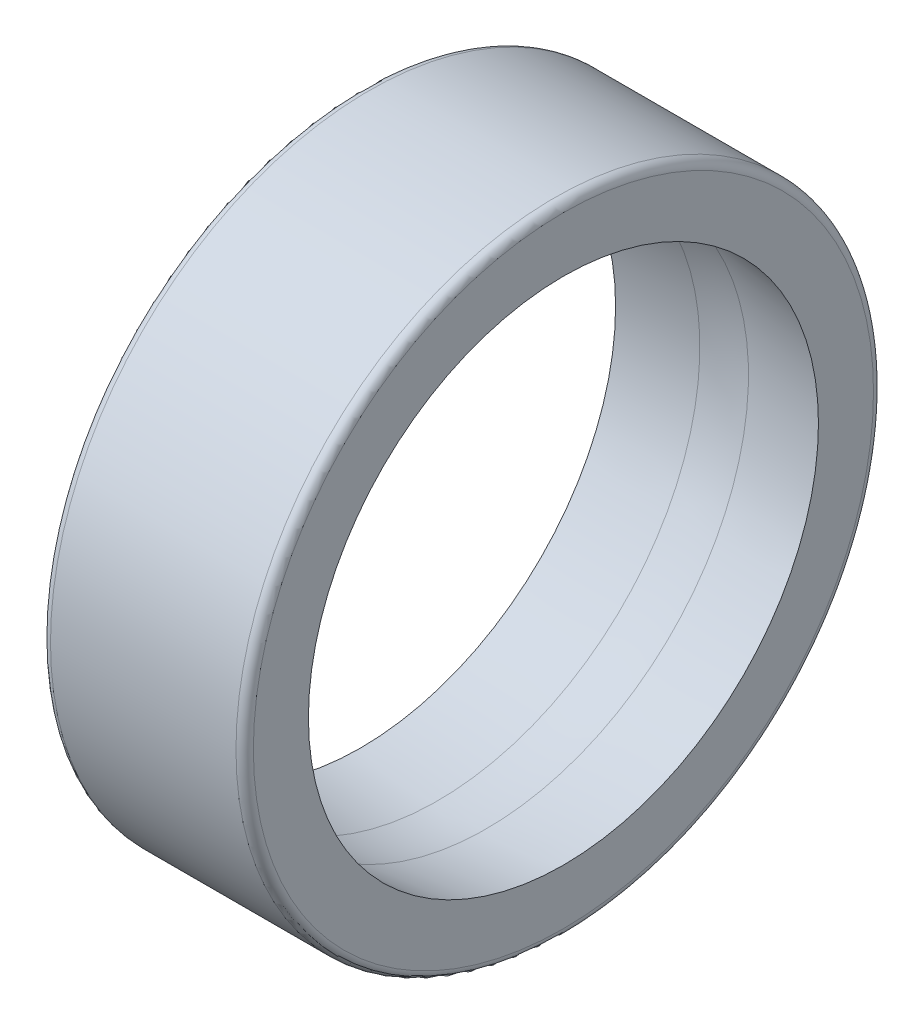
ISO-10303-21;
HEADER;
FILE_DESCRIPTION(('STEP AP214'),'2;1');
FILE_NAME('part.step','',(''),(''),'','','');
FILE_SCHEMA(('AUTOMOTIVE_DESIGN { 1 0 10303 214 1 1 1 1 }'));
ENDSEC;
DATA;
#1=APPLICATION_CONTEXT('core data for automotive mechanical design processes');
#2=APPLICATION_PROTOCOL_DEFINITION('international standard','automotive_design',2000,#1);
#3=PRODUCT_CONTEXT('',#1,'mechanical');
#4=PRODUCT('Part','Part','',(#3));
#5=PRODUCT_RELATED_PRODUCT_CATEGORY('part','',(#4));
#6=PRODUCT_DEFINITION_FORMATION('','',#4);
#7=PRODUCT_DEFINITION_CONTEXT('part definition',#1,'design');
#8=PRODUCT_DEFINITION('design','',#6,#7);
#9=PRODUCT_DEFINITION_SHAPE('','',#8);
#10=(LENGTH_UNIT() NAMED_UNIT(*) SI_UNIT(.MILLI.,.METRE.));
#11=(NAMED_UNIT(*) PLANE_ANGLE_UNIT() SI_UNIT($,.RADIAN.));
#12=(NAMED_UNIT(*) SI_UNIT($,.STERADIAN.) SOLID_ANGLE_UNIT());
#13=UNCERTAINTY_MEASURE_WITH_UNIT(LENGTH_MEASURE(1.E-05),#10,'distance_accuracy_value','');
#14=(GEOMETRIC_REPRESENTATION_CONTEXT(3) GLOBAL_UNCERTAINTY_ASSIGNED_CONTEXT((#13)) GLOBAL_UNIT_ASSIGNED_CONTEXT((#10,
#11,#12)) REPRESENTATION_CONTEXT('',''));
#15=CARTESIAN_POINT('',(0.,0.,0.));
#16=DIRECTION('',(0.,0.,1.));
#17=DIRECTION('',(1.,0.,0.));
#18=AXIS2_PLACEMENT_3D('',#15,#16,#17);
#19=CARTESIAN_POINT('',(0.,10.7,0.));
#20=DIRECTION('',(1.,0.,0.));
#21=DIRECTION('',(0.,0.,-1.));
#22=AXIS2_PLACEMENT_3D('',#19,#20,#21);
#23=PLANE('',#22);
#24=CARTESIAN_POINT('',(0.,0.,0.));
#25=DIRECTION('',(-1.,0.,0.));
#26=DIRECTION('',(0.,0.,1.));
#27=AXIS2_PLACEMENT_3D('',#24,#25,#26);
#28=CIRCLE('',#27,8.8);
#29=CARTESIAN_POINT('',(0.,0.,8.8));
#30=VERTEX_POINT('',#29);
#31=EDGE_CURVE('E61',#30,#30,#28,.T.);
#32=ORIENTED_EDGE('',*,*,#31,.F.);
#33=EDGE_LOOP('',(#32));
#34=FACE_BOUND('',#33,.T.);
#35=CARTESIAN_POINT('',(0.,0.,0.));
#36=DIRECTION('',(-1.,0.,0.));
#37=DIRECTION('',(0.,0.,1.));
#38=AXIS2_PLACEMENT_3D('',#35,#36,#37);
#39=CIRCLE('',#38,10.7);
#40=CARTESIAN_POINT('',(0.,0.,10.7));
#41=VERTEX_POINT('',#40);
#42=EDGE_CURVE('E10',#41,#41,#39,.T.);
#43=ORIENTED_EDGE('',*,*,#42,.T.);
#44=EDGE_LOOP('',(#43));
#45=FACE_BOUND('',#44,.T.);
#46=ADVANCED_FACE('F33',(#34,#45),#23,.F.);
#47=CARTESIAN_POINT('',(0.299999999999937,0.,0.));
#48=DIRECTION('',(-1.,0.,0.));
#49=DIRECTION('',(0.,0.,1.));
#50=AXIS2_PLACEMENT_3D('',#47,#48,#49);
#51=TOROIDAL_SURFACE('',#50,10.7000000000001,0.299999999999937);
#52=ORIENTED_EDGE('',*,*,#42,.F.);
#53=EDGE_LOOP('',(#52));
#54=FACE_BOUND('',#53,.T.);
#55=CARTESIAN_POINT('',(0.300000000000002,0.,0.));
#56=DIRECTION('',(-1.,0.,0.));
#57=DIRECTION('',(0.,0.,1.));
#58=AXIS2_PLACEMENT_3D('',#55,#56,#57);
#59=CIRCLE('',#58,11.);
#60=CARTESIAN_POINT('',(0.300000000000002,0.,11.));
#61=VERTEX_POINT('',#60);
#62=EDGE_CURVE('E39',#61,#61,#59,.T.);
#63=ORIENTED_EDGE('',*,*,#62,.T.);
#64=EDGE_LOOP('',(#63));
#65=FACE_BOUND('',#64,.T.);
#66=ADVANCED_FACE('F68',(#54,#65),#51,.T.);
#67=CARTESIAN_POINT('',(50.,0.,0.));
#68=DIRECTION('',(-1.,0.,0.));
#69=DIRECTION('',(0.,0.,1.));
#70=AXIS2_PLACEMENT_3D('',#67,#68,#69);
#71=CYLINDRICAL_SURFACE('',#70,11.);
#72=ORIENTED_EDGE('',*,*,#62,.F.);
#73=EDGE_LOOP('',(#72));
#74=FACE_BOUND('',#73,.T.);
#75=CARTESIAN_POINT('',(6.7,0.,0.));
#76=DIRECTION('',(-1.,0.,0.));
#77=DIRECTION('',(0.,0.,1.));
#78=AXIS2_PLACEMENT_3D('',#75,#76,#77);
#79=CIRCLE('',#78,11.);
#80=CARTESIAN_POINT('',(6.7,0.,11.));
#81=VERTEX_POINT('',#80);
#82=EDGE_CURVE('E43',#81,#81,#79,.T.);
#83=ORIENTED_EDGE('',*,*,#82,.T.);
#84=EDGE_LOOP('',(#83));
#85=FACE_BOUND('',#84,.T.);
#86=ADVANCED_FACE('F72',(#74,#85),#71,.T.);
#87=CARTESIAN_POINT('',(6.70000000000012,0.,0.));
#88=DIRECTION('',(-1.,0.,0.));
#89=DIRECTION('',(0.,0.,1.));
#90=AXIS2_PLACEMENT_3D('',#87,#88,#89);
#91=TOROIDAL_SURFACE('',#90,10.7000000000001,0.299999999999876);
#92=ORIENTED_EDGE('',*,*,#82,.F.);
#93=EDGE_LOOP('',(#92));
#94=FACE_BOUND('',#93,.T.);
#95=CARTESIAN_POINT('',(7.,0.,0.));
#96=DIRECTION('',(-1.,0.,0.));
#97=DIRECTION('',(0.,0.,1.));
#98=AXIS2_PLACEMENT_3D('',#95,#96,#97);
#99=CIRCLE('',#98,10.7);
#100=CARTESIAN_POINT('',(7.,0.,10.7));
#101=VERTEX_POINT('',#100);
#102=EDGE_CURVE('E47',#101,#101,#99,.T.);
#103=ORIENTED_EDGE('',*,*,#102,.T.);
#104=EDGE_LOOP('',(#103));
#105=FACE_BOUND('',#104,.T.);
#106=ADVANCED_FACE('F77',(#94,#105),#91,.T.);
#107=CARTESIAN_POINT('',(7.,8.8,0.));
#108=DIRECTION('',(-1.,0.,0.));
#109=DIRECTION('',(0.,0.,1.));
#110=AXIS2_PLACEMENT_3D('',#107,#108,#109);
#111=PLANE('',#110);
#112=ORIENTED_EDGE('',*,*,#102,.F.);
#113=EDGE_LOOP('',(#112));
#114=FACE_BOUND('',#113,.T.);
#115=CARTESIAN_POINT('',(7.,0.,0.));
#116=DIRECTION('',(-1.,0.,0.));
#117=DIRECTION('',(0.,0.,1.));
#118=AXIS2_PLACEMENT_3D('',#115,#116,#117);
#119=CIRCLE('',#118,8.8);
#120=CARTESIAN_POINT('',(7.,0.,8.8));
#121=VERTEX_POINT('',#120);
#122=EDGE_CURVE('E52',#121,#121,#119,.T.);
#123=ORIENTED_EDGE('',*,*,#122,.T.);
#124=EDGE_LOOP('',(#123));
#125=FACE_BOUND('',#124,.T.);
#126=ADVANCED_FACE('F83',(#114,#125),#111,.F.);
#127=CARTESIAN_POINT('',(4.3387953834593,0.,0.));
#128=DIRECTION('',(-1.,0.,0.));
#129=DIRECTION('',(0.,0.,1.));
#130=AXIS2_PLACEMENT_3D('',#127,#128,#129);
#131=CONICAL_SURFACE('',#130,9.0467415085828,0.0924536519333492);
#132=ORIENTED_EDGE('',*,*,#122,.F.);
#133=EDGE_LOOP('',(#132));
#134=FACE_BOUND('',#133,.T.);
#135=CARTESIAN_POINT('',(4.3387953834593,0.,0.));
#136=DIRECTION('',(-1.,0.,0.));
#137=DIRECTION('',(0.,0.,1.));
#138=AXIS2_PLACEMENT_3D('',#135,#136,#137);
#139=CIRCLE('',#138,9.0467415085828);
#140=CARTESIAN_POINT('',(4.3387953834593,0.,9.0467415085828));
#141=VERTEX_POINT('',#140);
#142=EDGE_CURVE('E55',#141,#141,#139,.T.);
#143=ORIENTED_EDGE('',*,*,#142,.T.);
#144=EDGE_LOOP('',(#143));
#145=FACE_BOUND('',#144,.T.);
#146=ADVANCED_FACE('F87',(#134,#145),#131,.F.);
#147=CARTESIAN_POINT('',(3.50000000000004,2.02961570466842E-06,0.));
#148=DIRECTION('',(-1.,0.,0.));
#149=DIRECTION('',(0.,1.,0.));
#150=AXIS2_PLACEMENT_3D('',#147,#148,#149);
#151=SPHERICAL_SURFACE('',#150,9.08554197038429);
#152=ORIENTED_EDGE('',*,*,#142,.F.);
#153=EDGE_LOOP('',(#152));
#154=FACE_BOUND('',#153,.T.);
#155=CARTESIAN_POINT('',(2.6612046165407,0.,0.));
#156=DIRECTION('',(-1.,0.,0.));
#157=DIRECTION('',(0.,0.,1.));
#158=AXIS2_PLACEMENT_3D('',#155,#156,#157);
#159=CIRCLE('',#158,9.0467415085828);
#160=CARTESIAN_POINT('',(2.6612046165407,0.,9.0467415085828));
#161=VERTEX_POINT('',#160);
#162=EDGE_CURVE('E58',#161,#161,#159,.T.);
#163=ORIENTED_EDGE('',*,*,#162,.T.);
#164=EDGE_LOOP('',(#163));
#165=FACE_BOUND('',#164,.T.);
#166=ADVANCED_FACE('F91',(#154,#165),#151,.F.);
#167=CARTESIAN_POINT('',(0.,0.,0.));
#168=DIRECTION('',(1.,0.,0.));
#169=DIRECTION('',(0.,0.,-1.));
#170=AXIS2_PLACEMENT_3D('',#167,#168,#169);
#171=CONICAL_SURFACE('',#170,8.8,0.0924536519333479);
#172=ORIENTED_EDGE('',*,*,#162,.F.);
#173=EDGE_LOOP('',(#172));
#174=FACE_BOUND('',#173,.T.);
#175=ORIENTED_EDGE('',*,*,#31,.T.);
#176=EDGE_LOOP('',(#175));
#177=FACE_BOUND('',#176,.T.);
#178=ADVANCED_FACE('F65',(#174,#177),#171,.F.);
#179=CLOSED_SHELL('',(#46,#66,#86,#106,#126,#146,#166,#178));
#180=MANIFOLD_SOLID_BREP('B2',#179);
#181=ADVANCED_BREP_SHAPE_REPRESENTATION('',(#18,#180),#14);
#182=SHAPE_DEFINITION_REPRESENTATION(#9,#181);
ENDSEC;
END-ISO-10303-21;
